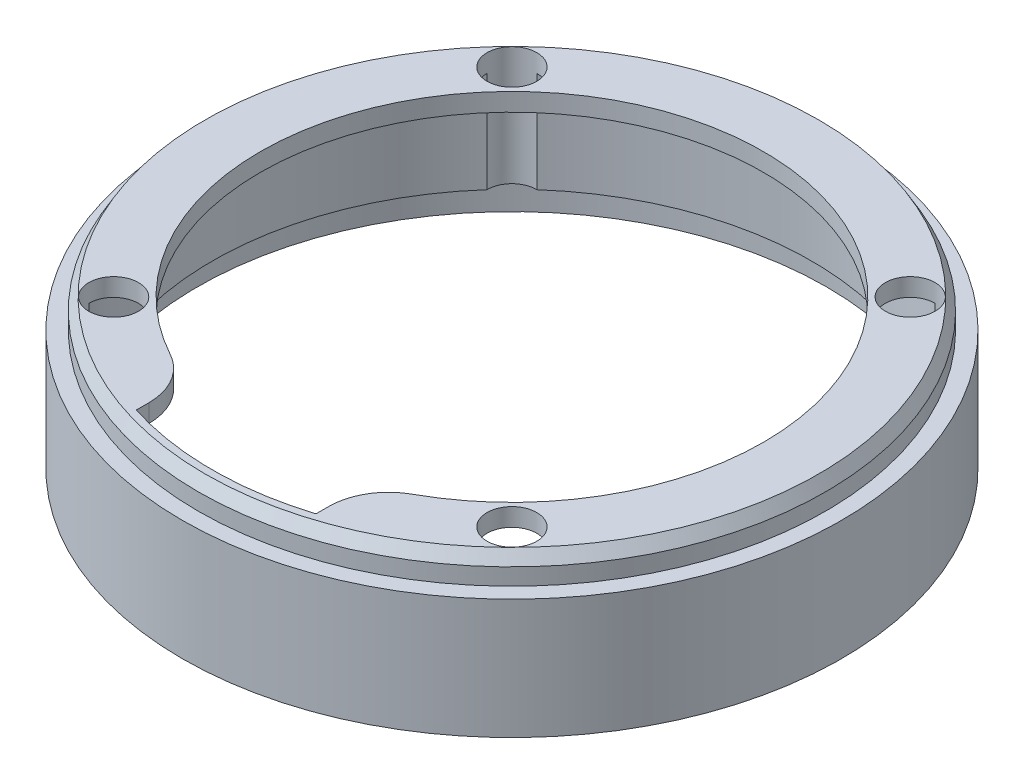
ISO-10303-21;
HEADER;
FILE_DESCRIPTION(('STEP AP214'),'2;1');
FILE_NAME('part.step','',(''),(''),'','','');
FILE_SCHEMA(('AUTOMOTIVE_DESIGN { 1 0 10303 214 1 1 1 1 }'));
ENDSEC;
DATA;
#1=APPLICATION_CONTEXT('core data for automotive mechanical design processes');
#2=APPLICATION_PROTOCOL_DEFINITION('international standard','automotive_design',2000,#1);
#3=PRODUCT_CONTEXT('',#1,'mechanical');
#4=PRODUCT('Part','Part','',(#3));
#5=PRODUCT_RELATED_PRODUCT_CATEGORY('part','',(#4));
#6=PRODUCT_DEFINITION_FORMATION('','',#4);
#7=PRODUCT_DEFINITION_CONTEXT('part definition',#1,'design');
#8=PRODUCT_DEFINITION('design','',#6,#7);
#9=PRODUCT_DEFINITION_SHAPE('','',#8);
#10=(LENGTH_UNIT() NAMED_UNIT(*) SI_UNIT(.MILLI.,.METRE.));
#11=(NAMED_UNIT(*) PLANE_ANGLE_UNIT() SI_UNIT($,.RADIAN.));
#12=(NAMED_UNIT(*) SI_UNIT($,.STERADIAN.) SOLID_ANGLE_UNIT());
#13=UNCERTAINTY_MEASURE_WITH_UNIT(LENGTH_MEASURE(1.E-05),#10,'distance_accuracy_value','');
#14=(GEOMETRIC_REPRESENTATION_CONTEXT(3) GLOBAL_UNCERTAINTY_ASSIGNED_CONTEXT((#13)) GLOBAL_UNIT_ASSIGNED_CONTEXT((#10,
#11,#12)) REPRESENTATION_CONTEXT('',''));
#15=CARTESIAN_POINT('',(0.,0.,0.));
#16=DIRECTION('',(0.,0.,1.));
#17=DIRECTION('',(1.,0.,0.));
#18=AXIS2_PLACEMENT_3D('',#15,#16,#17);
#19=CARTESIAN_POINT('',(0.,24.8,0.));
#20=DIRECTION('',(0.,-1.,0.));
#21=DIRECTION('',(0.,0.,-1.));
#22=AXIS2_PLACEMENT_3D('',#19,#20,#21);
#23=CYLINDRICAL_SURFACE('',#22,50.);
#24=DIRECTION('',(0.,1.,0.));
#25=VECTOR('',#24,1.);
#26=CARTESIAN_POINT('',(-33.203068739609,12.4,-37.383903304401));
#27=LINE('',#26,#25);
#28=CARTESIAN_POINT('',(-33.203068739609,5.,-37.383903304401));
#29=VERTEX_POINT('',#28);
#30=CARTESIAN_POINT('',(-33.203068739609,21.8,-37.383903304401));
#31=VERTEX_POINT('',#30);
#32=EDGE_CURVE('E155',#29,#31,#27,.T.);
#33=ORIENTED_EDGE('',*,*,#32,.F.);
#34=CARTESIAN_POINT('',(0.,5.,0.));
#35=DIRECTION('',(0.,-1.,0.));
#36=DIRECTION('',(0.,0.,-1.));
#37=AXIS2_PLACEMENT_3D('',#34,#35,#36);
#38=CIRCLE('',#37,50.);
#39=CARTESIAN_POINT('',(33.203068739609,5.,-37.383903304401));
#40=VERTEX_POINT('',#39);
#41=EDGE_CURVE('E52',#29,#40,#38,.T.);
#42=ORIENTED_EDGE('',*,*,#41,.T.);
#43=DIRECTION('',(0.,1.,0.));
#44=VECTOR('',#43,1.);
#45=CARTESIAN_POINT('',(33.203068739609,12.4,-37.383903304401));
#46=LINE('',#45,#44);
#47=CARTESIAN_POINT('',(33.203068739609,21.8,-37.3839033044009));
#48=VERTEX_POINT('',#47);
#49=EDGE_CURVE('E160',#48,#40,#46,.F.);
#50=ORIENTED_EDGE('',*,*,#49,.F.);
#51=CARTESIAN_POINT('',(0.,21.8,0.));
#52=DIRECTION('',(0.,-1.,0.));
#53=DIRECTION('',(0.,0.,-1.));
#54=AXIS2_PLACEMENT_3D('',#51,#52,#53);
#55=CIRCLE('',#54,50.);
#56=EDGE_CURVE('E283',#31,#48,#55,.T.);
#57=ORIENTED_EDGE('',*,*,#56,.F.);
#58=EDGE_LOOP('',(#33,#42,#50,#57));
#59=FACE_BOUND('',#58,.T.);
#60=ADVANCED_FACE('F38',(#59),#23,.F.);
#61=DIRECTION('',(0.,1.,0.));
#62=VECTOR('',#61,1.);
#63=CARTESIAN_POINT('',(37.383903304401,12.4,-33.203068739609));
#64=LINE('',#63,#62);
#65=CARTESIAN_POINT('',(37.383903304401,5.,-33.203068739609));
#66=VERTEX_POINT('',#65);
#67=CARTESIAN_POINT('',(37.383903304401,21.8,-33.203068739609));
#68=VERTEX_POINT('',#67);
#69=EDGE_CURVE('E156',#66,#68,#64,.T.);
#70=ORIENTED_EDGE('',*,*,#69,.F.);
#71=CARTESIAN_POINT('',(0.,5.,0.));
#72=DIRECTION('',(0.,-1.,0.));
#73=DIRECTION('',(0.,0.,-1.));
#74=AXIS2_PLACEMENT_3D('',#71,#72,#73);
#75=CIRCLE('',#74,50.);
#76=CARTESIAN_POINT('',(37.383903304401,5.,33.203068739609));
#77=VERTEX_POINT('',#76);
#78=EDGE_CURVE('E315',#66,#77,#75,.T.);
#79=ORIENTED_EDGE('',*,*,#78,.T.);
#80=DIRECTION('',(0.,1.,0.));
#81=VECTOR('',#80,1.);
#82=CARTESIAN_POINT('',(37.383903304401,12.4,33.203068739609));
#83=LINE('',#82,#81);
#84=CARTESIAN_POINT('',(37.383903304401,21.8,33.203068739609));
#85=VERTEX_POINT('',#84);
#86=EDGE_CURVE('E266',#85,#77,#83,.F.);
#87=ORIENTED_EDGE('',*,*,#86,.F.);
#88=EDGE_CURVE('E290',#68,#85,#55,.T.);
#89=ORIENTED_EDGE('',*,*,#88,.F.);
#90=EDGE_LOOP('',(#70,#79,#87,#89));
#91=FACE_BOUND('',#90,.T.);
#92=ADVANCED_FACE('F362',(#91),#23,.F.);
#93=DIRECTION('',(0.,1.,0.));
#94=VECTOR('',#93,1.);
#95=CARTESIAN_POINT('',(33.203068739609,12.4,37.383903304401));
#96=LINE('',#95,#94);
#97=CARTESIAN_POINT('',(33.203068739609,5.,37.383903304401));
#98=VERTEX_POINT('',#97);
#99=CARTESIAN_POINT('',(33.203068739609,21.8,37.3839033044009));
#100=VERTEX_POINT('',#99);
#101=EDGE_CURVE('E270',#98,#100,#96,.T.);
#102=ORIENTED_EDGE('',*,*,#101,.F.);
#103=CARTESIAN_POINT('',(0.,5.,0.));
#104=DIRECTION('',(0.,-1.,0.));
#105=DIRECTION('',(0.,0.,-1.));
#106=AXIS2_PLACEMENT_3D('',#103,#104,#105);
#107=CIRCLE('',#106,50.);
#108=CARTESIAN_POINT('',(-33.203068739609,5.,37.383903304401));
#109=VERTEX_POINT('',#108);
#110=EDGE_CURVE('E318',#98,#109,#107,.T.);
#111=ORIENTED_EDGE('',*,*,#110,.T.);
#112=DIRECTION('',(0.,1.,0.));
#113=VECTOR('',#112,1.);
#114=CARTESIAN_POINT('',(-33.203068739609,12.4,37.383903304401));
#115=LINE('',#114,#113);
#116=CARTESIAN_POINT('',(-33.203068739609,21.8,37.383903304401));
#117=VERTEX_POINT('',#116);
#118=EDGE_CURVE('E166',#117,#109,#115,.F.);
#119=ORIENTED_EDGE('',*,*,#118,.F.);
#120=CARTESIAN_POINT('',(-15.,21.8,47.6969600708473));
#121=VERTEX_POINT('',#120);
#122=EDGE_CURVE('E289',#121,#117,#55,.T.);
#123=ORIENTED_EDGE('',*,*,#122,.F.);
#124=DIRECTION('',(0.,-1.,0.));
#125=VECTOR('',#124,1.);
#126=CARTESIAN_POINT('',(-15.,24.8,47.6969600708473));
#127=LINE('',#126,#125);
#128=CARTESIAN_POINT('',(-15.,24.8,47.6969600708473));
#129=VERTEX_POINT('',#128);
#130=EDGE_CURVE('E287',#129,#121,#127,.T.);
#131=ORIENTED_EDGE('',*,*,#130,.F.);
#132=CARTESIAN_POINT('',(0.,24.8,-3.9343528435154E-12));
#133=DIRECTION('',(0.,-1.,0.));
#134=DIRECTION('',(0.,0.,-1.));
#135=AXIS2_PLACEMENT_3D('',#132,#133,#134);
#136=CIRCLE('',#135,50.0000000000038);
#137=CARTESIAN_POINT('',(15.,24.8,47.6969600708473));
#138=VERTEX_POINT('',#137);
#139=EDGE_CURVE('E238',#138,#129,#136,.T.);
#140=ORIENTED_EDGE('',*,*,#139,.F.);
#141=DIRECTION('',(0.,-1.,0.));
#142=VECTOR('',#141,1.);
#143=CARTESIAN_POINT('',(15.,24.8,47.6969600708473));
#144=LINE('',#143,#142);
#145=CARTESIAN_POINT('',(15.,21.8,47.6969600708473));
#146=VERTEX_POINT('',#145);
#147=EDGE_CURVE('E240',#138,#146,#144,.T.);
#148=ORIENTED_EDGE('',*,*,#147,.T.);
#149=EDGE_CURVE('E291',#100,#146,#55,.T.);
#150=ORIENTED_EDGE('',*,*,#149,.F.);
#151=EDGE_LOOP('',(#102,#111,#119,#123,#131,#140,#148,#150));
#152=FACE_BOUND('',#151,.T.);
#153=ADVANCED_FACE('F302',(#152),#23,.F.);
#154=DIRECTION('',(0.,1.,0.));
#155=VECTOR('',#154,1.);
#156=CARTESIAN_POINT('',(-37.383903304401,12.4,33.203068739609));
#157=LINE('',#156,#155);
#158=CARTESIAN_POINT('',(-37.3839033044009,5.,33.203068739609));
#159=VERTEX_POINT('',#158);
#160=CARTESIAN_POINT('',(-37.3839033044009,21.8,33.203068739609));
#161=VERTEX_POINT('',#160);
#162=EDGE_CURVE('E148',#159,#161,#157,.T.);
#163=ORIENTED_EDGE('',*,*,#162,.F.);
#164=CARTESIAN_POINT('',(0.,5.,0.));
#165=DIRECTION('',(0.,-1.,0.));
#166=DIRECTION('',(0.,0.,-1.));
#167=AXIS2_PLACEMENT_3D('',#164,#165,#166);
#168=CIRCLE('',#167,50.);
#169=CARTESIAN_POINT('',(-37.383903304401,5.,-33.203068739609));
#170=VERTEX_POINT('',#169);
#171=EDGE_CURVE('E137',#159,#170,#168,.T.);
#172=ORIENTED_EDGE('',*,*,#171,.T.);
#173=DIRECTION('',(0.,1.,0.));
#174=VECTOR('',#173,1.);
#175=CARTESIAN_POINT('',(-37.383903304401,12.4,-33.203068739609));
#176=LINE('',#175,#174);
#177=CARTESIAN_POINT('',(-37.3839033044009,21.8,-33.203068739609));
#178=VERTEX_POINT('',#177);
#179=EDGE_CURVE('E146',#178,#170,#176,.F.);
#180=ORIENTED_EDGE('',*,*,#179,.F.);
#181=EDGE_CURVE('E286',#161,#178,#55,.T.);
#182=ORIENTED_EDGE('',*,*,#181,.F.);
#183=EDGE_LOOP('',(#163,#172,#180,#182));
#184=FACE_BOUND('',#183,.T.);
#185=ADVANCED_FACE('F144',(#184),#23,.F.);
#186=CARTESIAN_POINT('',(-33.2340187157677,0.,33.2340187157678));
#187=DIRECTION('',(0.,1.,0.));
#188=DIRECTION('',(0.,0.,1.));
#189=AXIS2_PLACEMENT_3D('',#186,#187,#188);
#190=CYLINDRICAL_SURFACE('',#189,4.15);
#191=CARTESIAN_POINT('',(-33.2340187157677,24.8,33.2340187157678));
#192=DIRECTION('',(0.,1.,0.));
#193=DIRECTION('',(0.,0.,1.));
#194=AXIS2_PLACEMENT_3D('',#191,#192,#193);
#195=CIRCLE('',#194,4.15);
#196=CARTESIAN_POINT('',(-33.2340187157677,24.8,37.3840187157678));
#197=VERTEX_POINT('',#196);
#198=EDGE_CURVE('E158',#197,#197,#195,.T.);
#199=ORIENTED_EDGE('',*,*,#198,.T.);
#200=EDGE_LOOP('',(#199));
#201=FACE_BOUND('',#200,.T.);
#202=CARTESIAN_POINT('',(-33.2340187157677,5.,33.2340187157678));
#203=DIRECTION('',(0.,-1.,0.));
#204=DIRECTION('',(0.,0.,-1.));
#205=AXIS2_PLACEMENT_3D('',#202,#203,#204);
#206=CIRCLE('',#205,4.15);
#207=EDGE_CURVE('E320',#159,#109,#206,.F.);
#208=ORIENTED_EDGE('',*,*,#207,.F.);
#209=ORIENTED_EDGE('',*,*,#162,.T.);
#210=CARTESIAN_POINT('',(-33.2340187157677,21.8,33.2340187157678));
#211=DIRECTION('',(0.,-1.,0.));
#212=DIRECTION('',(0.,0.,-1.));
#213=AXIS2_PLACEMENT_3D('',#210,#211,#212);
#214=CIRCLE('',#213,4.15);
#215=EDGE_CURVE('E257',#117,#161,#214,.F.);
#216=ORIENTED_EDGE('',*,*,#215,.F.);
#217=ORIENTED_EDGE('',*,*,#118,.T.);
#218=EDGE_LOOP('',(#208,#209,#216,#217));
#219=FACE_BOUND('',#218,.T.);
#220=ADVANCED_FACE('F370',(#201,#219),#190,.F.);
#221=CARTESIAN_POINT('',(33.2340187157678,0.,33.2340187157677));
#222=DIRECTION('',(0.,1.,0.));
#223=DIRECTION('',(0.,0.,1.));
#224=AXIS2_PLACEMENT_3D('',#221,#222,#223);
#225=CYLINDRICAL_SURFACE('',#224,4.15);
#226=CARTESIAN_POINT('',(33.2340187157678,24.8,33.2340187157677));
#227=DIRECTION('',(0.,1.,0.));
#228=DIRECTION('',(0.,0.,1.));
#229=AXIS2_PLACEMENT_3D('',#226,#227,#228);
#230=CIRCLE('',#229,4.15);
#231=CARTESIAN_POINT('',(33.2340187157678,24.8,37.3840187157677));
#232=VERTEX_POINT('',#231);
#233=EDGE_CURVE('E224',#232,#232,#230,.T.);
#234=ORIENTED_EDGE('',*,*,#233,.T.);
#235=EDGE_LOOP('',(#234));
#236=FACE_BOUND('',#235,.T.);
#237=CARTESIAN_POINT('',(33.2340187157678,5.,33.2340187157677));
#238=DIRECTION('',(0.,-1.,0.));
#239=DIRECTION('',(0.,0.,-1.));
#240=AXIS2_PLACEMENT_3D('',#237,#238,#239);
#241=CIRCLE('',#240,4.15);
#242=EDGE_CURVE('E313',#98,#77,#241,.F.);
#243=ORIENTED_EDGE('',*,*,#242,.F.);
#244=ORIENTED_EDGE('',*,*,#101,.T.);
#245=CARTESIAN_POINT('',(33.2340187157678,21.8,33.2340187157677));
#246=DIRECTION('',(0.,-1.,0.));
#247=DIRECTION('',(0.,0.,-1.));
#248=AXIS2_PLACEMENT_3D('',#245,#246,#247);
#249=CIRCLE('',#248,4.15);
#250=EDGE_CURVE('E261',#85,#100,#249,.F.);
#251=ORIENTED_EDGE('',*,*,#250,.F.);
#252=ORIENTED_EDGE('',*,*,#86,.T.);
#253=EDGE_LOOP('',(#243,#244,#251,#252));
#254=FACE_BOUND('',#253,.T.);
#255=ADVANCED_FACE('F375',(#236,#254),#225,.F.);
#256=CARTESIAN_POINT('',(33.2340187157678,0.,-33.2340187157677));
#257=DIRECTION('',(0.,1.,0.));
#258=DIRECTION('',(0.,0.,1.));
#259=AXIS2_PLACEMENT_3D('',#256,#257,#258);
#260=CYLINDRICAL_SURFACE('',#259,4.15);
#261=CARTESIAN_POINT('',(33.2340187157678,24.8,-33.2340187157677));
#262=DIRECTION('',(0.,1.,0.));
#263=DIRECTION('',(0.,0.,1.));
#264=AXIS2_PLACEMENT_3D('',#261,#262,#263);
#265=CIRCLE('',#264,4.15);
#266=CARTESIAN_POINT('',(33.2340187157678,24.8,-29.0840187157677));
#267=VERTEX_POINT('',#266);
#268=EDGE_CURVE('E228',#267,#267,#265,.T.);
#269=ORIENTED_EDGE('',*,*,#268,.T.);
#270=EDGE_LOOP('',(#269));
#271=FACE_BOUND('',#270,.T.);
#272=CARTESIAN_POINT('',(33.2340187157678,5.,-33.2340187157677));
#273=DIRECTION('',(0.,-1.,0.));
#274=DIRECTION('',(0.,0.,-1.));
#275=AXIS2_PLACEMENT_3D('',#272,#273,#274);
#276=CIRCLE('',#275,4.15);
#277=EDGE_CURVE('E276',#66,#40,#276,.F.);
#278=ORIENTED_EDGE('',*,*,#277,.F.);
#279=ORIENTED_EDGE('',*,*,#69,.T.);
#280=CARTESIAN_POINT('',(33.2340187157678,21.8,-33.2340187157677));
#281=DIRECTION('',(0.,-1.,0.));
#282=DIRECTION('',(0.,0.,-1.));
#283=AXIS2_PLACEMENT_3D('',#280,#281,#282);
#284=CIRCLE('',#283,4.15);
#285=EDGE_CURVE('E279',#48,#68,#284,.F.);
#286=ORIENTED_EDGE('',*,*,#285,.F.);
#287=ORIENTED_EDGE('',*,*,#49,.T.);
#288=EDGE_LOOP('',(#278,#279,#286,#287));
#289=FACE_BOUND('',#288,.T.);
#290=ADVANCED_FACE('F275',(#271,#289),#260,.F.);
#291=CARTESIAN_POINT('',(-33.2340187157677,0.,-33.2340187157678));
#292=DIRECTION('',(0.,1.,0.));
#293=DIRECTION('',(0.,0.,1.));
#294=AXIS2_PLACEMENT_3D('',#291,#292,#293);
#295=CYLINDRICAL_SURFACE('',#294,4.15);
#296=CARTESIAN_POINT('',(-33.2340187157677,24.8,-33.2340187157678));
#297=DIRECTION('',(0.,1.,0.));
#298=DIRECTION('',(0.,0.,1.));
#299=AXIS2_PLACEMENT_3D('',#296,#297,#298);
#300=CIRCLE('',#299,4.15);
#301=CARTESIAN_POINT('',(-33.2340187157677,24.8,-29.0840187157678));
#302=VERTEX_POINT('',#301);
#303=EDGE_CURVE('E231',#302,#302,#300,.T.);
#304=ORIENTED_EDGE('',*,*,#303,.T.);
#305=EDGE_LOOP('',(#304));
#306=FACE_BOUND('',#305,.T.);
#307=CARTESIAN_POINT('',(-33.2340187157677,5.,-33.2340187157678));
#308=DIRECTION('',(0.,-1.,0.));
#309=DIRECTION('',(0.,0.,-1.));
#310=AXIS2_PLACEMENT_3D('',#307,#308,#309);
#311=CIRCLE('',#310,4.15);
#312=EDGE_CURVE('E12',#29,#170,#311,.F.);
#313=ORIENTED_EDGE('',*,*,#312,.F.);
#314=ORIENTED_EDGE('',*,*,#32,.T.);
#315=CARTESIAN_POINT('',(-33.2340187157677,21.8,-33.2340187157678));
#316=DIRECTION('',(0.,-1.,0.));
#317=DIRECTION('',(0.,0.,-1.));
#318=AXIS2_PLACEMENT_3D('',#315,#316,#317);
#319=CIRCLE('',#318,4.15);
#320=EDGE_CURVE('E154',#178,#31,#319,.F.);
#321=ORIENTED_EDGE('',*,*,#320,.F.);
#322=ORIENTED_EDGE('',*,*,#179,.T.);
#323=EDGE_LOOP('',(#313,#314,#321,#322));
#324=FACE_BOUND('',#323,.T.);
#325=ADVANCED_FACE('F152',(#306,#324),#295,.F.);
#326=CARTESIAN_POINT('',(0.,24.8,0.));
#327=DIRECTION('',(0.,-1.,0.));
#328=DIRECTION('',(0.,0.,-1.));
#329=AXIS2_PLACEMENT_3D('',#326,#327,#328);
#330=CYLINDRICAL_SURFACE('',#329,55.);
#331=CARTESIAN_POINT('',(0.,0.,0.));
#332=DIRECTION('',(0.,1.,0.));
#333=DIRECTION('',(0.,0.,1.));
#334=AXIS2_PLACEMENT_3D('',#331,#332,#333);
#335=CIRCLE('',#334,55.);
#336=CARTESIAN_POINT('',(0.,0.,55.));
#337=VERTEX_POINT('',#336);
#338=EDGE_CURVE('E173',#337,#337,#335,.T.);
#339=ORIENTED_EDGE('',*,*,#338,.T.);
#340=EDGE_LOOP('',(#339));
#341=FACE_BOUND('',#340,.T.);
#342=CARTESIAN_POINT('',(0.,20.,0.));
#343=DIRECTION('',(0.,1.,0.));
#344=DIRECTION('',(0.,0.,1.));
#345=AXIS2_PLACEMENT_3D('',#342,#343,#344);
#346=CIRCLE('',#345,55.);
#347=CARTESIAN_POINT('',(0.,20.,55.));
#348=VERTEX_POINT('',#347);
#349=EDGE_CURVE('E197',#348,#348,#346,.T.);
#350=ORIENTED_EDGE('',*,*,#349,.F.);
#351=EDGE_LOOP('',(#350));
#352=FACE_BOUND('',#351,.T.);
#353=ADVANCED_FACE('F217',(#341,#352),#330,.T.);
#354=CARTESIAN_POINT('',(0.,24.8,0.));
#355=DIRECTION('',(0.,1.,0.));
#356=DIRECTION('',(0.,0.,1.));
#357=AXIS2_PLACEMENT_3D('',#354,#355,#356);
#358=PLANE('',#357);
#359=CARTESIAN_POINT('',(0.,24.8,0.));
#360=DIRECTION('',(0.,1.,0.));
#361=DIRECTION('',(0.,0.,1.));
#362=AXIS2_PLACEMENT_3D('',#359,#360,#361);
#363=CIRCLE('',#362,51.1952994616208);
#364=CARTESIAN_POINT('',(0.,24.8,51.1952994616208));
#365=VERTEX_POINT('',#364);
#366=EDGE_CURVE('E196',#365,#365,#363,.T.);
#367=ORIENTED_EDGE('',*,*,#366,.T.);
#368=EDGE_LOOP('',(#367));
#369=FACE_BOUND('',#368,.T.);
#370=ORIENTED_EDGE('',*,*,#198,.F.);
#371=EDGE_LOOP('',(#370));
#372=FACE_BOUND('',#371,.T.);
#373=ORIENTED_EDGE('',*,*,#233,.F.);
#374=EDGE_LOOP('',(#373));
#375=FACE_BOUND('',#374,.T.);
#376=ORIENTED_EDGE('',*,*,#268,.F.);
#377=EDGE_LOOP('',(#376));
#378=FACE_BOUND('',#377,.T.);
#379=ORIENTED_EDGE('',*,*,#303,.F.);
#380=EDGE_LOOP('',(#379));
#381=FACE_BOUND('',#380,.T.);
#382=DIRECTION('',(0.,0.,-1.));
#383=VECTOR('',#382,1.);
#384=CARTESIAN_POINT('',(-15.,24.8,33.2340187157678));
#385=LINE('',#384,#383);
#386=CARTESIAN_POINT('',(-15.,24.8,45.596052460712));
#387=VERTEX_POINT('',#386);
#388=EDGE_CURVE('E235',#129,#387,#385,.T.);
#389=ORIENTED_EDGE('',*,*,#388,.T.);
#390=CARTESIAN_POINT('',(-25.,24.8,45.596052460712));
#391=DIRECTION('',(0.,1.,0.));
#392=DIRECTION('',(0.,0.,1.));
#393=AXIS2_PLACEMENT_3D('',#390,#391,#392);
#394=CIRCLE('',#393,10.);
#395=CARTESIAN_POINT('',(-20.1923076923077,24.8,36.827580833652));
#396=VERTEX_POINT('',#395);
#397=EDGE_CURVE('E192',#387,#396,#394,.T.);
#398=ORIENTED_EDGE('',*,*,#397,.T.);
#399=CARTESIAN_POINT('',(0.,24.8,0.));
#400=DIRECTION('',(0.,1.,0.));
#401=DIRECTION('',(0.,0.,1.));
#402=AXIS2_PLACEMENT_3D('',#399,#400,#401);
#403=CIRCLE('',#402,42.);
#404=CARTESIAN_POINT('',(20.1923076923077,24.8,36.827580833652));
#405=VERTEX_POINT('',#404);
#406=EDGE_CURVE('E170',#405,#396,#403,.T.);
#407=ORIENTED_EDGE('',*,*,#406,.F.);
#408=CARTESIAN_POINT('',(25.,24.8,45.596052460712));
#409=DIRECTION('',(0.,1.,0.));
#410=DIRECTION('',(0.,0.,1.));
#411=AXIS2_PLACEMENT_3D('',#408,#409,#410);
#412=CIRCLE('',#411,10.);
#413=CARTESIAN_POINT('',(15.,24.8,45.596052460712));
#414=VERTEX_POINT('',#413);
#415=EDGE_CURVE('E60',#405,#414,#412,.T.);
#416=ORIENTED_EDGE('',*,*,#415,.T.);
#417=DIRECTION('',(0.,0.,1.));
#418=VECTOR('',#417,1.);
#419=CARTESIAN_POINT('',(15.,24.8,33.2340187157678));
#420=LINE('',#419,#418);
#421=EDGE_CURVE('E307',#414,#138,#420,.T.);
#422=ORIENTED_EDGE('',*,*,#421,.T.);
#423=ORIENTED_EDGE('',*,*,#139,.T.);
#424=EDGE_LOOP('',(#389,#398,#407,#416,#422,#423));
#425=FACE_BOUND('',#424,.T.);
#426=ADVANCED_FACE('F213',(#369,#372,#375,#378,#381,#425),#358,.T.);
#427=CARTESIAN_POINT('',(0.,0.,0.));
#428=DIRECTION('',(0.,1.,0.));
#429=DIRECTION('',(0.,0.,1.));
#430=AXIS2_PLACEMENT_3D('',#427,#428,#429);
#431=CYLINDRICAL_SURFACE('',#430,42.);
#432=ORIENTED_EDGE('',*,*,#406,.T.);
#433=DIRECTION('',(0.,1.,0.));
#434=VECTOR('',#433,1.);
#435=CARTESIAN_POINT('',(-20.1923076923077,0.,36.827580833652));
#436=LINE('',#435,#434);
#437=CARTESIAN_POINT('',(-20.1923076923077,21.8,36.827580833652));
#438=VERTEX_POINT('',#437);
#439=EDGE_CURVE('E182',#396,#438,#436,.F.);
#440=ORIENTED_EDGE('',*,*,#439,.T.);
#441=CARTESIAN_POINT('',(0.,21.8,0.));
#442=DIRECTION('',(0.,-1.,0.));
#443=DIRECTION('',(0.,0.,-1.));
#444=AXIS2_PLACEMENT_3D('',#441,#442,#443);
#445=CIRCLE('',#444,42.);
#446=CARTESIAN_POINT('',(20.1923076923077,21.8,36.827580833652));
#447=VERTEX_POINT('',#446);
#448=EDGE_CURVE('E249',#447,#438,#445,.F.);
#449=ORIENTED_EDGE('',*,*,#448,.F.);
#450=DIRECTION('',(0.,1.,0.));
#451=VECTOR('',#450,1.);
#452=CARTESIAN_POINT('',(20.1923076923077,0.,36.827580833652));
#453=LINE('',#452,#451);
#454=EDGE_CURVE('E179',#447,#405,#453,.T.);
#455=ORIENTED_EDGE('',*,*,#454,.T.);
#456=EDGE_LOOP('',(#432,#440,#449,#455));
#457=FACE_BOUND('',#456,.T.);
#458=ADVANCED_FACE('F216',(#457),#431,.F.);
#459=CARTESIAN_POINT('',(0.,0.,0.));
#460=DIRECTION('',(0.,1.,0.));
#461=DIRECTION('',(0.,0.,1.));
#462=AXIS2_PLACEMENT_3D('',#459,#460,#461);
#463=PLANE('',#462);
#464=CARTESIAN_POINT('',(0.,0.,0.));
#465=DIRECTION('',(0.,-1.,0.));
#466=DIRECTION('',(0.,0.,-1.));
#467=AXIS2_PLACEMENT_3D('',#464,#465,#466);
#468=CIRCLE('',#467,52.5);
#469=CARTESIAN_POINT('',(0.,0.,-52.5));
#470=VERTEX_POINT('',#469);
#471=EDGE_CURVE('E324',#470,#470,#468,.T.);
#472=ORIENTED_EDGE('',*,*,#471,.F.);
#473=EDGE_LOOP('',(#472));
#474=FACE_BOUND('',#473,.T.);
#475=ORIENTED_EDGE('',*,*,#338,.F.);
#476=EDGE_LOOP('',(#475));
#477=FACE_BOUND('',#476,.T.);
#478=ADVANCED_FACE('F337',(#474,#477),#463,.F.);
#479=CARTESIAN_POINT('',(0.,21.8,0.));
#480=DIRECTION('',(0.,-1.,0.));
#481=DIRECTION('',(0.,0.,-1.));
#482=AXIS2_PLACEMENT_3D('',#479,#480,#481);
#483=PLANE('',#482);
#484=ORIENTED_EDGE('',*,*,#448,.T.);
#485=CARTESIAN_POINT('',(-25.,21.8,45.596052460712));
#486=DIRECTION('',(0.,-1.,0.));
#487=DIRECTION('',(0.,0.,-1.));
#488=AXIS2_PLACEMENT_3D('',#485,#486,#487);
#489=CIRCLE('',#488,10.);
#490=CARTESIAN_POINT('',(-15.,21.8,45.596052460712));
#491=VERTEX_POINT('',#490);
#492=EDGE_CURVE('E187',#438,#491,#489,.T.);
#493=ORIENTED_EDGE('',*,*,#492,.T.);
#494=DIRECTION('',(0.,0.,-1.));
#495=VECTOR('',#494,1.);
#496=CARTESIAN_POINT('',(-15.,21.8,33.2340187157678));
#497=LINE('',#496,#495);
#498=EDGE_CURVE('E200',#121,#491,#497,.T.);
#499=ORIENTED_EDGE('',*,*,#498,.F.);
#500=ORIENTED_EDGE('',*,*,#122,.T.);
#501=ORIENTED_EDGE('',*,*,#215,.T.);
#502=ORIENTED_EDGE('',*,*,#181,.T.);
#503=ORIENTED_EDGE('',*,*,#320,.T.);
#504=ORIENTED_EDGE('',*,*,#56,.T.);
#505=ORIENTED_EDGE('',*,*,#285,.T.);
#506=ORIENTED_EDGE('',*,*,#88,.T.);
#507=ORIENTED_EDGE('',*,*,#250,.T.);
#508=ORIENTED_EDGE('',*,*,#149,.T.);
#509=DIRECTION('',(0.,0.,1.));
#510=VECTOR('',#509,1.);
#511=CARTESIAN_POINT('',(15.,21.8,0.));
#512=LINE('',#511,#510);
#513=CARTESIAN_POINT('',(15.,21.8,45.596052460712));
#514=VERTEX_POINT('',#513);
#515=EDGE_CURVE('E177',#514,#146,#512,.T.);
#516=ORIENTED_EDGE('',*,*,#515,.F.);
#517=CARTESIAN_POINT('',(25.,21.8,45.596052460712));
#518=DIRECTION('',(0.,-1.,0.));
#519=DIRECTION('',(0.,0.,-1.));
#520=AXIS2_PLACEMENT_3D('',#517,#518,#519);
#521=CIRCLE('',#520,10.);
#522=EDGE_CURVE('E185',#514,#447,#521,.T.);
#523=ORIENTED_EDGE('',*,*,#522,.T.);
#524=EDGE_LOOP('',(#484,#493,#499,#500,#501,#502,#503,#504,#505,#506,#507,#508,#516,#523));
#525=FACE_BOUND('',#524,.T.);
#526=ADVANCED_FACE('F252',(#525),#483,.T.);
#527=CARTESIAN_POINT('',(-15.,24.8,33.2340187157678));
#528=DIRECTION('',(-1.,0.,0.));
#529=DIRECTION('',(0.,0.,1.));
#530=AXIS2_PLACEMENT_3D('',#527,#528,#529);
#531=PLANE('',#530);
#532=ORIENTED_EDGE('',*,*,#498,.T.);
#533=DIRECTION('',(0.,1.,0.));
#534=VECTOR('',#533,1.);
#535=CARTESIAN_POINT('',(-15.,24.8,45.596052460712));
#536=LINE('',#535,#534);
#537=EDGE_CURVE('E189',#491,#387,#536,.T.);
#538=ORIENTED_EDGE('',*,*,#537,.T.);
#539=ORIENTED_EDGE('',*,*,#388,.F.);
#540=ORIENTED_EDGE('',*,*,#130,.T.);
#541=EDGE_LOOP('',(#532,#538,#539,#540));
#542=FACE_BOUND('',#541,.T.);
#543=ADVANCED_FACE('F447',(#542),#531,.F.);
#544=CARTESIAN_POINT('',(15.,24.8,33.2340187157678));
#545=DIRECTION('',(1.,0.,0.));
#546=DIRECTION('',(0.,0.,-1.));
#547=AXIS2_PLACEMENT_3D('',#544,#545,#546);
#548=PLANE('',#547);
#549=ORIENTED_EDGE('',*,*,#421,.F.);
#550=DIRECTION('',(0.,1.,0.));
#551=VECTOR('',#550,1.);
#552=CARTESIAN_POINT('',(15.,24.8,45.596052460712));
#553=LINE('',#552,#551);
#554=EDGE_CURVE('E194',#414,#514,#553,.F.);
#555=ORIENTED_EDGE('',*,*,#554,.T.);
#556=ORIENTED_EDGE('',*,*,#515,.T.);
#557=ORIENTED_EDGE('',*,*,#147,.F.);
#558=EDGE_LOOP('',(#549,#555,#556,#557));
#559=FACE_BOUND('',#558,.T.);
#560=ADVANCED_FACE('F438',(#559),#548,.F.);
#561=CARTESIAN_POINT('',(-25.,0.,45.596052460712));
#562=DIRECTION('',(0.,1.,0.));
#563=DIRECTION('',(0.,0.,1.));
#564=AXIS2_PLACEMENT_3D('',#561,#562,#563);
#565=CYLINDRICAL_SURFACE('',#564,10.);
#566=ORIENTED_EDGE('',*,*,#397,.F.);
#567=ORIENTED_EDGE('',*,*,#537,.F.);
#568=ORIENTED_EDGE('',*,*,#492,.F.);
#569=ORIENTED_EDGE('',*,*,#439,.F.);
#570=EDGE_LOOP('',(#566,#567,#568,#569));
#571=FACE_BOUND('',#570,.T.);
#572=ADVANCED_FACE('F245',(#571),#565,.T.);
#573=CARTESIAN_POINT('',(25.,0.,45.596052460712));
#574=DIRECTION('',(0.,1.,0.));
#575=DIRECTION('',(0.,0.,1.));
#576=AXIS2_PLACEMENT_3D('',#573,#574,#575);
#577=CYLINDRICAL_SURFACE('',#576,10.);
#578=ORIENTED_EDGE('',*,*,#522,.F.);
#579=ORIENTED_EDGE('',*,*,#554,.F.);
#580=ORIENTED_EDGE('',*,*,#415,.F.);
#581=ORIENTED_EDGE('',*,*,#454,.F.);
#582=EDGE_LOOP('',(#578,#579,#580,#581));
#583=FACE_BOUND('',#582,.T.);
#584=ADVANCED_FACE('F350',(#583),#577,.T.);
#585=CARTESIAN_POINT('',(0.,20.,0.));
#586=DIRECTION('',(0.,1.,0.));
#587=DIRECTION('',(0.,0.,1.));
#588=AXIS2_PLACEMENT_3D('',#585,#586,#587);
#589=PLANE('',#588);
#590=CARTESIAN_POINT('',(0.,20.,0.));
#591=DIRECTION('',(0.,1.,0.));
#592=DIRECTION('',(0.,0.,1.));
#593=AXIS2_PLACEMENT_3D('',#590,#591,#592);
#594=CIRCLE('',#593,52.35);
#595=CARTESIAN_POINT('',(0.,20.,52.35));
#596=VERTEX_POINT('',#595);
#597=EDGE_CURVE('E201',#596,#596,#594,.T.);
#598=ORIENTED_EDGE('',*,*,#597,.F.);
#599=EDGE_LOOP('',(#598));
#600=FACE_BOUND('',#599,.T.);
#601=ORIENTED_EDGE('',*,*,#349,.T.);
#602=EDGE_LOOP('',(#601));
#603=FACE_BOUND('',#602,.T.);
#604=ADVANCED_FACE('F348',(#600,#603),#589,.T.);
#605=CARTESIAN_POINT('',(0.,20.,0.));
#606=DIRECTION('',(0.,1.,0.));
#607=DIRECTION('',(0.,0.,1.));
#608=AXIS2_PLACEMENT_3D('',#605,#606,#607);
#609=CYLINDRICAL_SURFACE('',#608,52.35);
#610=CARTESIAN_POINT('',(0.,22.8,0.));
#611=DIRECTION('',(0.,1.,0.));
#612=DIRECTION('',(0.,0.,1.));
#613=AXIS2_PLACEMENT_3D('',#610,#611,#612);
#614=CIRCLE('',#613,52.35);
#615=CARTESIAN_POINT('',(0.,22.8,52.35));
#616=VERTEX_POINT('',#615);
#617=EDGE_CURVE('E46',#616,#616,#614,.F.);
#618=ORIENTED_EDGE('',*,*,#617,.T.);
#619=EDGE_LOOP('',(#618));
#620=FACE_BOUND('',#619,.T.);
#621=ORIENTED_EDGE('',*,*,#597,.T.);
#622=EDGE_LOOP('',(#621));
#623=FACE_BOUND('',#622,.T.);
#624=ADVANCED_FACE('F206',(#620,#623),#609,.T.);
#625=CARTESIAN_POINT('',(0.,24.8,0.));
#626=DIRECTION('',(0.,-1.,0.));
#627=DIRECTION('',(0.,0.,-1.));
#628=AXIS2_PLACEMENT_3D('',#625,#626,#627);
#629=CONICAL_SURFACE('',#628,51.1952994616208,0.523598775598297);
#630=ORIENTED_EDGE('',*,*,#617,.F.);
#631=EDGE_LOOP('',(#630));
#632=FACE_BOUND('',#631,.T.);
#633=ORIENTED_EDGE('',*,*,#366,.F.);
#634=EDGE_LOOP('',(#633));
#635=FACE_BOUND('',#634,.T.);
#636=ADVANCED_FACE('F40',(#632,#635),#629,.T.);
#637=CARTESIAN_POINT('',(0.,5.,0.));
#638=DIRECTION('',(0.,-1.,0.));
#639=DIRECTION('',(0.,0.,-1.));
#640=AXIS2_PLACEMENT_3D('',#637,#638,#639);
#641=PLANE('',#640);
#642=CARTESIAN_POINT('',(0.,5.,0.));
#643=DIRECTION('',(0.,-1.,0.));
#644=DIRECTION('',(0.,0.,-1.));
#645=AXIS2_PLACEMENT_3D('',#642,#643,#644);
#646=CIRCLE('',#645,52.5);
#647=CARTESIAN_POINT('',(0.,5.,-52.5));
#648=VERTEX_POINT('',#647);
#649=EDGE_CURVE('E149',#648,#648,#646,.T.);
#650=ORIENTED_EDGE('',*,*,#649,.T.);
#651=EDGE_LOOP('',(#650));
#652=FACE_BOUND('',#651,.T.);
#653=ORIENTED_EDGE('',*,*,#242,.T.);
#654=ORIENTED_EDGE('',*,*,#78,.F.);
#655=ORIENTED_EDGE('',*,*,#277,.T.);
#656=ORIENTED_EDGE('',*,*,#41,.F.);
#657=ORIENTED_EDGE('',*,*,#312,.T.);
#658=ORIENTED_EDGE('',*,*,#171,.F.);
#659=ORIENTED_EDGE('',*,*,#207,.T.);
#660=ORIENTED_EDGE('',*,*,#110,.F.);
#661=EDGE_LOOP('',(#653,#654,#655,#656,#657,#658,#659,#660));
#662=FACE_BOUND('',#661,.T.);
#663=ADVANCED_FACE('F136',(#652,#662),#641,.T.);
#664=CARTESIAN_POINT('',(0.,5.,0.));
#665=DIRECTION('',(0.,-1.,0.));
#666=DIRECTION('',(0.,0.,-1.));
#667=AXIS2_PLACEMENT_3D('',#664,#665,#666);
#668=CYLINDRICAL_SURFACE('',#667,52.5);
#669=ORIENTED_EDGE('',*,*,#649,.F.);
#670=EDGE_LOOP('',(#669));
#671=FACE_BOUND('',#670,.T.);
#672=ORIENTED_EDGE('',*,*,#471,.T.);
#673=EDGE_LOOP('',(#672));
#674=FACE_BOUND('',#673,.T.);
#675=ADVANCED_FACE('F331',(#671,#674),#668,.F.);
#676=CLOSED_SHELL('',(#60,#92,#153,#185,#220,#255,#290,#325,#353,#426,#458,#478,#526,#543,#560,
#572,#584,#604,#624,#636,#663,#675));
#677=MANIFOLD_SOLID_BREP('B2',#676);
#678=ADVANCED_BREP_SHAPE_REPRESENTATION('',(#18,#677),#14);
#679=SHAPE_DEFINITION_REPRESENTATION(#9,#678);
ENDSEC;
END-ISO-10303-21;
